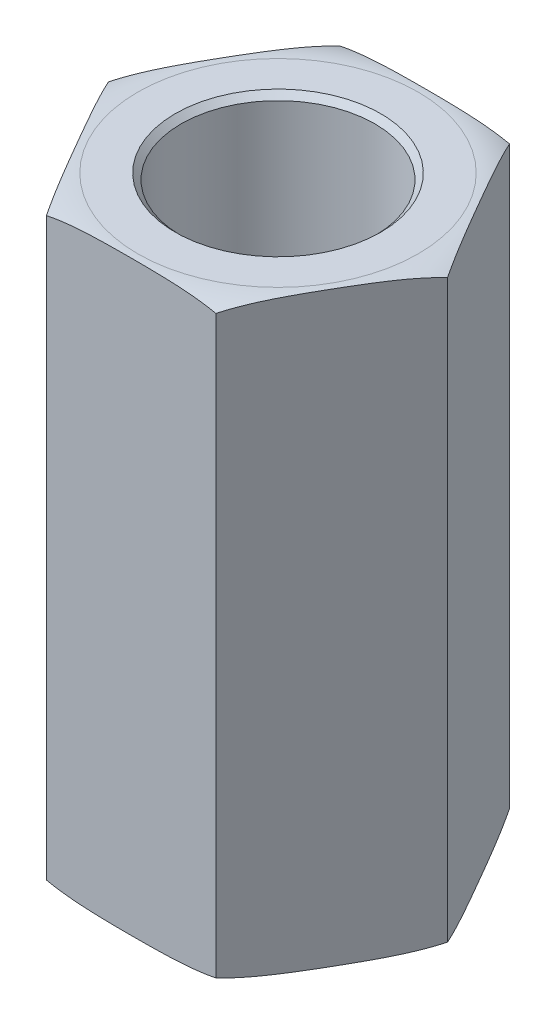
ISO-10303-21;
HEADER;
FILE_DESCRIPTION(('STEP AP214'),'2;1');
FILE_NAME('part.step','',(''),(''),'','','');
FILE_SCHEMA(('AUTOMOTIVE_DESIGN { 1 0 10303 214 1 1 1 1 }'));
ENDSEC;
DATA;
#1=APPLICATION_CONTEXT('core data for automotive mechanical design processes');
#2=APPLICATION_PROTOCOL_DEFINITION('international standard','automotive_design',2000,#1);
#3=PRODUCT_CONTEXT('',#1,'mechanical');
#4=PRODUCT('Part','Part','',(#3));
#5=PRODUCT_RELATED_PRODUCT_CATEGORY('part','',(#4));
#6=PRODUCT_DEFINITION_FORMATION('','',#4);
#7=PRODUCT_DEFINITION_CONTEXT('part definition',#1,'design');
#8=PRODUCT_DEFINITION('design','',#6,#7);
#9=PRODUCT_DEFINITION_SHAPE('','',#8);
#10=(LENGTH_UNIT() NAMED_UNIT(*) SI_UNIT(.MILLI.,.METRE.));
#11=(NAMED_UNIT(*) PLANE_ANGLE_UNIT() SI_UNIT($,.RADIAN.));
#12=(NAMED_UNIT(*) SI_UNIT($,.STERADIAN.) SOLID_ANGLE_UNIT());
#13=UNCERTAINTY_MEASURE_WITH_UNIT(LENGTH_MEASURE(1.E-05),#10,'distance_accuracy_value','');
#14=(GEOMETRIC_REPRESENTATION_CONTEXT(3) GLOBAL_UNCERTAINTY_ASSIGNED_CONTEXT((#13)) GLOBAL_UNIT_ASSIGNED_CONTEXT((#10,
#11,#12)) REPRESENTATION_CONTEXT('',''));
#15=CARTESIAN_POINT('',(0.,0.,0.));
#16=DIRECTION('',(0.,0.,1.));
#17=DIRECTION('',(1.,0.,0.));
#18=AXIS2_PLACEMENT_3D('',#15,#16,#17);
#19=CARTESIAN_POINT('',(3.66617420935412,6.35,0.));
#20=DIRECTION('',(-0.866025403784439,0.,0.5));
#21=DIRECTION('',(0.5,0.,0.866025403784439));
#22=AXIS2_PLACEMENT_3D('',#19,#20,#21);
#23=PLANE('',#22);
#24=DIRECTION('',(0.,1.,0.));
#25=VECTOR('',#24,1.);
#26=CARTESIAN_POINT('',(1.83308710467704,6.35,-3.175));
#27=LINE('',#26,#25);
#28=CARTESIAN_POINT('',(1.83308710467705,-6.223,-3.175));
#29=VERTEX_POINT('',#28);
#30=CARTESIAN_POINT('',(1.83308710467706,6.223,-3.175));
#31=VERTEX_POINT('',#30);
#32=EDGE_CURVE('E144',#29,#31,#27,.T.);
#33=ORIENTED_EDGE('',*,*,#32,.T.);
#34=CARTESIAN_POINT('',(3.66617420935412,6.223,0.));
#35=CARTESIAN_POINT('',(3.62797961467394,6.23890141489968,-0.0661549785605611));
#36=CARTESIAN_POINT('',(3.58956810864156,6.2524886076105,-0.132685658603882));
#37=CARTESIAN_POINT('',(3.5124905179571,6.27581619794021,-0.266187961794374));
#38=CARTESIAN_POINT('',(3.47382473049845,6.28556047713974,-0.33315907018741));
#39=CARTESIAN_POINT('',(3.39641631867871,6.3019966530451,-0.467234372392409));
#40=CARTESIAN_POINT('',(3.3576739963331,6.30869453286691,-0.534338043098217));
#41=CARTESIAN_POINT('',(3.28009834620111,6.31977675729319,-0.668703010557023));
#42=CARTESIAN_POINT('',(3.24126499587768,6.32416045047396,-0.735964346345314));
#43=CARTESIAN_POINT('',(3.16354065964311,6.33124030042628,-0.870586845688153));
#44=CARTESIAN_POINT('',(3.12464965374472,6.33393552375912,-0.937948043861629));
#45=CARTESIAN_POINT('',(3.04685144594589,6.33815319837134,-1.07269849250701));
#46=CARTESIAN_POINT('',(3.00794424351965,6.33967560802717,-1.14008774388963));
#47=CARTESIAN_POINT('',(2.93051517598868,6.34192270588903,-1.27419882283594));
#48=CARTESIAN_POINT('',(2.89199336248929,6.34265524681808,-1.34092056101658));
#49=CARTESIAN_POINT('',(2.81494778346138,6.34357673025741,-1.47436741839149));
#50=CARTESIAN_POINT('',(2.77642401791433,6.3437656658949,-1.54109253761784));
#51=CARTESIAN_POINT('',(2.69935964431006,6.34366599668056,-1.67457194815391));
#52=CARTESIAN_POINT('',(2.66081903631815,6.34337718117655,-1.7413262393505));
#53=CARTESIAN_POINT('',(2.58373908085323,6.34222198621899,-1.87483263846089));
#54=CARTESIAN_POINT('',(2.54519973341238,6.34135559703857,-1.94158474631899));
#55=CARTESIAN_POINT('',(2.46812969629763,6.33878619406563,-2.07507396634296));
#56=CARTESIAN_POINT('',(2.42959900625957,6.33708322716165,-2.14181107913956));
#57=CARTESIAN_POINT('',(2.352556513409,6.3324387229726,-2.27525259109851));
#58=CARTESIAN_POINT('',(2.31404470975434,6.3294972471358,-2.3419569917195));
#59=CARTESIAN_POINT('',(2.25084206239936,6.32321741247487,-2.45142718811118));
#60=CARTESIAN_POINT('',(2.22613849337002,6.32039801104631,-2.49421502479829));
#61=CARTESIAN_POINT('',(2.17676945272221,6.31386967943035,-2.57972471152123));
#62=CARTESIAN_POINT('',(2.15210397034177,6.31016108091389,-2.62244658019735));
#63=CARTESIAN_POINT('',(2.1028275381169,6.30168027114968,-2.70779586442654));
#64=CARTESIAN_POINT('',(2.07821657107524,6.29690846570083,-2.7504233097661));
#65=CARTESIAN_POINT('',(2.02900094683545,6.28609877125158,-2.83566727147563));
#66=CARTESIAN_POINT('',(2.0043964608546,6.28005773130841,-2.87828349128859));
#67=CARTESIAN_POINT('',(1.95527325900931,6.26651383541611,-2.96336737271509));
#68=CARTESIAN_POINT('',(1.93075459617612,6.25901019780296,-3.00583494247583));
#69=CARTESIAN_POINT('',(1.8818215737317,6.24232035070844,-3.09058942351747));
#70=CARTESIAN_POINT('',(1.85740744053269,6.23313149780328,-3.13287594264091));
#71=CARTESIAN_POINT('',(1.83308710467705,6.223,-3.175));
#72=B_SPLINE_CURVE_WITH_KNOTS('',3,(#34,#35,#36,#37,#38,#39,#40,#41,#42,#43,#44,#45,#46,#47,#48,
#49,#50,#51,#52,#53,#54,#55,#56,#57,#58,#59,#60,#61,#62,#63,#64,#65,#66,#67,#68,#69,#70,#71),
.UNSPECIFIED.,.F.,.F.,(4,2,2,2,2,2,2,2,2,2,2,2,2,2,2,2,2,2,4),(0.,0.233977307817956,
0.467717675040722,0.700996973557543,0.934341903229807,1.16781571967247,1.40129782179833,
1.6324366580968,1.86357841666628,2.09482211846307,2.32606971471509,2.55730435147413,
2.7885275169443,2.93698369265101,3.08538458004485,3.23372892334593,3.38244598546619,
3.53124274626087,3.68027493713585),.UNSPECIFIED.);
#73=CARTESIAN_POINT('',(3.66617420935412,6.223,0.));
#74=VERTEX_POINT('',#73);
#75=EDGE_CURVE('E96',#74,#31,#72,.T.);
#76=ORIENTED_EDGE('',*,*,#75,.F.);
#77=DIRECTION('',(0.,1.,0.));
#78=VECTOR('',#77,1.);
#79=CARTESIAN_POINT('',(3.66617420935412,6.35,0.));
#80=LINE('',#79,#78);
#81=CARTESIAN_POINT('',(3.66617420935412,-6.223,0.));
#82=VERTEX_POINT('',#81);
#83=EDGE_CURVE('E146',#74,#82,#80,.F.);
#84=ORIENTED_EDGE('',*,*,#83,.T.);
#85=CARTESIAN_POINT('',(1.83308710467705,-6.223,-3.17500000000001));
#86=CARTESIAN_POINT('',(1.87128169935723,-6.23890141489968,-3.10884502143945));
#87=CARTESIAN_POINT('',(1.90969320538961,-6.2524886076105,-3.04231434139613));
#88=CARTESIAN_POINT('',(1.98677079607407,-6.2758161979402,-2.90881203820564));
#89=CARTESIAN_POINT('',(2.02543658353272,-6.28556047713974,-2.8418409298126));
#90=CARTESIAN_POINT('',(2.10284499535245,-6.30199665304509,-2.70776562760761));
#91=CARTESIAN_POINT('',(2.14158731769806,-6.30869453286691,-2.6406619569018));
#92=CARTESIAN_POINT('',(2.21916296783006,-6.31977675729319,-2.506296989443));
#93=CARTESIAN_POINT('',(2.25799631815348,-6.32416045047396,-2.43903565365471));
#94=CARTESIAN_POINT('',(2.33572065438805,-6.33124030042628,-2.30441315431187));
#95=CARTESIAN_POINT('',(2.37461166028644,-6.33393552375912,-2.2370519561384));
#96=CARTESIAN_POINT('',(2.45240986808527,-6.33815319837134,-2.10230150749301));
#97=CARTESIAN_POINT('',(2.49131707051151,-6.33967560802717,-2.0349122561104));
#98=CARTESIAN_POINT('',(2.56874613804247,-6.34192270588903,-1.90080117716409));
#99=CARTESIAN_POINT('',(2.60726795154186,-6.34265524681808,-1.83407943898346));
#100=CARTESIAN_POINT('',(2.68431353056977,-6.34357673025741,-1.70063258160855));
#101=CARTESIAN_POINT('',(2.72283729611682,-6.3437656658949,-1.63390746238219));
#102=CARTESIAN_POINT('',(2.79990166972109,-6.34366599668056,-1.50042805184613));
#103=CARTESIAN_POINT('',(2.838442277713,-6.34337718117655,-1.43367376064954));
#104=CARTESIAN_POINT('',(2.91552223317792,-6.34222198621899,-1.30016736153915));
#105=CARTESIAN_POINT('',(2.95406158061877,-6.34135559703857,-1.23341525368106));
#106=CARTESIAN_POINT('',(3.03113161773352,-6.33878619406563,-1.09992603365709));
#107=CARTESIAN_POINT('',(3.06966230777158,-6.33708322716165,-1.03318892086049));
#108=CARTESIAN_POINT('',(3.14670480062215,-6.3324387229726,-0.89974740890154));
#109=CARTESIAN_POINT('',(3.18521660427681,-6.3294972471358,-0.833043008280553));
#110=CARTESIAN_POINT('',(3.24841925163179,-6.32321741247488,-0.723572811888871));
#111=CARTESIAN_POINT('',(3.27312282066113,-6.32039801104631,-0.68078497520176));
#112=CARTESIAN_POINT('',(3.32249186130894,-6.31386967943036,-0.595275288478811));
#113=CARTESIAN_POINT('',(3.34715734368938,-6.3101610809139,-0.552553419802693));
#114=CARTESIAN_POINT('',(3.39643377591425,-6.30168027114969,-0.467204135573495));
#115=CARTESIAN_POINT('',(3.42104474295592,-6.29690846570084,-0.424576690233926));
#116=CARTESIAN_POINT('',(3.47026036719571,-6.28609877125159,-0.339332728524397));
#117=CARTESIAN_POINT('',(3.49486485317657,-6.28005773130841,-0.296716508711431));
#118=CARTESIAN_POINT('',(3.54398805502186,-6.26651383541611,-0.211632627284922));
#119=CARTESIAN_POINT('',(3.56850671785505,-6.25901019780296,-0.169165057524186));
#120=CARTESIAN_POINT('',(3.61743974029947,-6.24232035070844,-0.0844105764825379));
#121=CARTESIAN_POINT('',(3.64185387349848,-6.23313149780328,-0.0421240573590945));
#122=CARTESIAN_POINT('',(3.66617420935412,-6.223,0.));
#123=B_SPLINE_CURVE_WITH_KNOTS('',3,(#85,#86,#87,#88,#89,#90,#91,#92,#93,#94,#95,#96,#97,#98,
#99,#100,#101,#102,#103,#104,#105,#106,#107,#108,#109,#110,#111,#112,#113,#114,#115,#116,#117,
#118,#119,#120,#121,#122),.UNSPECIFIED.,.F.,.F.,(4,2,2,2,2,2,2,2,2,2,2,2,2,2,2,2,2,2,4),(0.,
0.233977307817951,0.467717675040713,0.700996973557529,0.934341903229788,1.16781571967244,
1.4012978217983,1.63243665809676,1.86357841666625,2.09482211846303,2.32606971471504,
2.55730435147408,2.78852751694424,2.93698369265097,3.08538458004482,3.23372892334591,
3.38244598546617,3.53124274626087,3.68027493713586),.UNSPECIFIED.);
#124=EDGE_CURVE('E224',#29,#82,#123,.T.);
#125=ORIENTED_EDGE('',*,*,#124,.F.);
#126=EDGE_LOOP('',(#33,#76,#84,#125));
#127=FACE_BOUND('',#126,.T.);
#128=ADVANCED_FACE('F16',(#127),#23,.F.);
#129=CARTESIAN_POINT('',(1.83308710467706,6.35,3.17499999999999));
#130=DIRECTION('',(-0.866025403784439,0.,-0.5));
#131=DIRECTION('',(-0.5,0.,0.866025403784439));
#132=AXIS2_PLACEMENT_3D('',#129,#130,#131);
#133=PLANE('',#132);
#134=ORIENTED_EDGE('',*,*,#83,.F.);
#135=CARTESIAN_POINT('',(1.83308710467706,6.223,3.17499999999999));
#136=CARTESIAN_POINT('',(1.87128169935724,6.23890141489968,3.10884502143943));
#137=CARTESIAN_POINT('',(1.90969320538962,6.2524886076105,3.04231434139611));
#138=CARTESIAN_POINT('',(1.98677079607408,6.27581619794021,2.90881203820562));
#139=CARTESIAN_POINT('',(2.02543658353273,6.28556047713974,2.84184092981258));
#140=CARTESIAN_POINT('',(2.10284499535247,6.3019966530451,2.70776562760758));
#141=CARTESIAN_POINT('',(2.14158731769808,6.30869453286691,2.64066195690177));
#142=CARTESIAN_POINT('',(2.21916296783007,6.31977675729319,2.50629698944297));
#143=CARTESIAN_POINT('',(2.2579963181535,6.32416045047396,2.43903565365468));
#144=CARTESIAN_POINT('',(2.33572065438807,6.33124030042628,2.30441315431184));
#145=CARTESIAN_POINT('',(2.37461166028646,6.33393552375912,2.23705195613836));
#146=CARTESIAN_POINT('',(2.45240986808529,6.33815319837134,2.10230150749298));
#147=CARTESIAN_POINT('',(2.49131707051153,6.33967560802717,2.03491225611036));
#148=CARTESIAN_POINT('',(2.5687461380425,6.34192270588903,1.90080117716405));
#149=CARTESIAN_POINT('',(2.60726795154189,6.34265524681808,1.83407943898341));
#150=CARTESIAN_POINT('',(2.6843135305698,6.34357673025741,1.7006325816085));
#151=CARTESIAN_POINT('',(2.72283729611685,6.3437656658949,1.63390746238215));
#152=CARTESIAN_POINT('',(2.79990166972112,6.34366599668056,1.50042805184608));
#153=CARTESIAN_POINT('',(2.83844227771304,6.34337718117655,1.43367376064949));
#154=CARTESIAN_POINT('',(2.91552223317796,6.34222198621899,1.3001673615391));
#155=CARTESIAN_POINT('',(2.9540615806188,6.34135559703857,1.233415253681));
#156=CARTESIAN_POINT('',(3.03113161773355,6.33878619406563,1.09992603365703));
#157=CARTESIAN_POINT('',(3.06966230777161,6.33708322716165,1.03318892086043));
#158=CARTESIAN_POINT('',(3.14670480062218,6.3324387229726,0.899747408901478));
#159=CARTESIAN_POINT('',(3.18521660427684,6.3294972471358,0.833043008280487));
#160=CARTESIAN_POINT('',(3.24841925163182,6.32321741247487,0.723572811888809));
#161=CARTESIAN_POINT('',(3.27312282066116,6.32039801104631,0.680784975201703));
#162=CARTESIAN_POINT('',(3.32249186130897,6.31386967943035,0.595275288478763));
#163=CARTESIAN_POINT('',(3.34715734368941,6.31016108091389,0.552553419802648));
#164=CARTESIAN_POINT('',(3.39643377591428,6.30168027114968,0.467204135573458));
#165=CARTESIAN_POINT('',(3.42104474295594,6.29690846570083,0.424576690233893));
#166=CARTESIAN_POINT('',(3.47026036719572,6.28609877125158,0.339332728524371));
#167=CARTESIAN_POINT('',(3.49486485317658,6.28005773130841,0.29671650871141));
#168=CARTESIAN_POINT('',(3.54398805502187,6.26651383541611,0.211632627284908));
#169=CARTESIAN_POINT('',(3.56850671785506,6.25901019780296,0.169165057524176));
#170=CARTESIAN_POINT('',(3.61743974029948,6.24232035070844,0.0844105764825357));
#171=CARTESIAN_POINT('',(3.64185387349849,6.23313149780328,0.0421240573590963));
#172=CARTESIAN_POINT('',(3.66617420935412,6.223,0.));
#173=B_SPLINE_CURVE_WITH_KNOTS('',3,(#135,#136,#137,#138,#139,#140,#141,#142,#143,#144,#145,
#146,#147,#148,#149,#150,#151,#152,#153,#154,#155,#156,#157,#158,#159,#160,#161,#162,#163,#164,
#165,#166,#167,#168,#169,#170,#171,#172),.UNSPECIFIED.,.F.,.F.,(4,2,2,2,2,2,2,2,2,2,2,2,2,2,2,2,
2,2,4),(0.,0.233977307817956,0.467717675040722,0.700996973557543,0.934341903229808,
1.16781571967247,1.40129782179833,1.6324366580968,1.86357841666628,2.09482211846307,
2.32606971471509,2.55730435147413,2.7885275169443,2.93698369265101,3.08538458004485,
3.23372892334593,3.38244598546618,3.53124274626086,3.68027493713584),.UNSPECIFIED.);
#174=CARTESIAN_POINT('',(1.83308710467706,6.223,3.17499999999999));
#175=VERTEX_POINT('',#174);
#176=EDGE_CURVE('E217',#175,#74,#173,.T.);
#177=ORIENTED_EDGE('',*,*,#176,.F.);
#178=DIRECTION('',(0.,1.,0.));
#179=VECTOR('',#178,1.);
#180=CARTESIAN_POINT('',(1.83308710467706,6.35,3.17499999999999));
#181=LINE('',#180,#179);
#182=CARTESIAN_POINT('',(1.83308710467706,-6.223,3.17499999999999));
#183=VERTEX_POINT('',#182);
#184=EDGE_CURVE('E141',#175,#183,#181,.F.);
#185=ORIENTED_EDGE('',*,*,#184,.T.);
#186=CARTESIAN_POINT('',(3.66617420935412,-6.223,0.));
#187=CARTESIAN_POINT('',(3.62797961467394,-6.23890141489968,0.0661549785605662));
#188=CARTESIAN_POINT('',(3.58956810864156,-6.2524886076105,0.132685658603887));
#189=CARTESIAN_POINT('',(3.5124905179571,-6.27581619794021,0.266187961794379));
#190=CARTESIAN_POINT('',(3.47382473049845,-6.28556047713974,0.333159070187415));
#191=CARTESIAN_POINT('',(3.39641631867871,-6.3019966530451,0.467234372392414));
#192=CARTESIAN_POINT('',(3.3576739963331,-6.30869453286691,0.534338043098222));
#193=CARTESIAN_POINT('',(3.28009834620111,-6.31977675729319,0.668703010557028));
#194=CARTESIAN_POINT('',(3.24126499587768,-6.32416045047396,0.73596434634532));
#195=CARTESIAN_POINT('',(3.16354065964311,-6.33124030042628,0.870586845688159));
#196=CARTESIAN_POINT('',(3.12464965374472,-6.33393552375912,0.937948043861634));
#197=CARTESIAN_POINT('',(3.04685144594589,-6.33815319837134,1.07269849250702));
#198=CARTESIAN_POINT('',(3.00794424351965,-6.33967560802717,1.14008774388963));
#199=CARTESIAN_POINT('',(2.93051517598868,-6.34192270588903,1.27419882283595));
#200=CARTESIAN_POINT('',(2.89199336248929,-6.34265524681808,1.34092056101658));
#201=CARTESIAN_POINT('',(2.81494778346138,-6.34357673025741,1.47436741839149));
#202=CARTESIAN_POINT('',(2.77642401791433,-6.3437656658949,1.54109253761785));
#203=CARTESIAN_POINT('',(2.69935964431006,-6.34366599668056,1.67457194815392));
#204=CARTESIAN_POINT('',(2.66081903631815,-6.34337718117655,1.74132623935051));
#205=CARTESIAN_POINT('',(2.58373908085322,-6.34222198621899,1.8748326384609));
#206=CARTESIAN_POINT('',(2.54519973341238,-6.34135559703857,1.941584746319));
#207=CARTESIAN_POINT('',(2.46812969629763,-6.33878619406563,2.07507396634296));
#208=CARTESIAN_POINT('',(2.42959900625957,-6.33708322716165,2.14181107913957));
#209=CARTESIAN_POINT('',(2.352556513409,-6.3324387229726,2.27525259109852));
#210=CARTESIAN_POINT('',(2.31404470975434,-6.3294972471358,2.34195699171951));
#211=CARTESIAN_POINT('',(2.25084206239936,-6.32321741247487,2.45142718811119));
#212=CARTESIAN_POINT('',(2.22613849337002,-6.32039801104631,2.49421502479829));
#213=CARTESIAN_POINT('',(2.17676945272221,-6.31386967943035,2.57972471152123));
#214=CARTESIAN_POINT('',(2.15210397034177,-6.31016108091389,2.62244658019735));
#215=CARTESIAN_POINT('',(2.1028275381169,-6.30168027114968,2.70779586442654));
#216=CARTESIAN_POINT('',(2.07821657107524,-6.29690846570083,2.7504233097661));
#217=CARTESIAN_POINT('',(2.02900094683546,-6.28609877125158,2.83566727147563));
#218=CARTESIAN_POINT('',(2.0043964608546,-6.28005773130841,2.87828349128859));
#219=CARTESIAN_POINT('',(1.95527325900931,-6.26651383541611,2.96336737271509));
#220=CARTESIAN_POINT('',(1.93075459617612,-6.25901019780296,3.00583494247582));
#221=CARTESIAN_POINT('',(1.88182157373171,-6.24232035070844,3.09058942351746));
#222=CARTESIAN_POINT('',(1.8574074405327,-6.23313149780328,3.1328759426409));
#223=CARTESIAN_POINT('',(1.83308710467706,-6.223,3.17499999999999));
#224=B_SPLINE_CURVE_WITH_KNOTS('',3,(#186,#187,#188,#189,#190,#191,#192,#193,#194,#195,#196,
#197,#198,#199,#200,#201,#202,#203,#204,#205,#206,#207,#208,#209,#210,#211,#212,#213,#214,#215,
#216,#217,#218,#219,#220,#221,#222,#223),.UNSPECIFIED.,.F.,.F.,(4,2,2,2,2,2,2,2,2,2,2,2,2,2,2,2,
2,2,4),(0.,0.233977307817956,0.467717675040723,0.700996973557543,0.934341903229807,
1.16781571967247,1.40129782179833,1.6324366580968,1.86357841666628,2.09482211846307,
2.32606971471509,2.55730435147414,2.7885275169443,2.93698369265102,3.08538458004485,
3.23372892334593,3.38244598546618,3.53124274626086,3.68027493713584),.UNSPECIFIED.);
#225=EDGE_CURVE('E246',#82,#183,#224,.T.);
#226=ORIENTED_EDGE('',*,*,#225,.F.);
#227=EDGE_LOOP('',(#134,#177,#185,#226));
#228=FACE_BOUND('',#227,.T.);
#229=ADVANCED_FACE('F221',(#228),#133,.F.);
#230=CARTESIAN_POINT('',(1.83308710467706,6.35,-3.175));
#231=DIRECTION('',(0.,0.,1.));
#232=DIRECTION('',(1.,0.,0.));
#233=AXIS2_PLACEMENT_3D('',#230,#231,#232);
#234=PLANE('',#233);
#235=DIRECTION('',(0.,1.,0.));
#236=VECTOR('',#235,1.);
#237=CARTESIAN_POINT('',(-1.83308710467707,6.35,-3.175));
#238=LINE('',#237,#236);
#239=CARTESIAN_POINT('',(-1.83308710467707,-6.223,-3.175));
#240=VERTEX_POINT('',#239);
#241=CARTESIAN_POINT('',(-1.83308710467706,6.223,-3.17500000000001));
#242=VERTEX_POINT('',#241);
#243=EDGE_CURVE('E103',#240,#242,#238,.T.);
#244=ORIENTED_EDGE('',*,*,#243,.T.);
#245=CARTESIAN_POINT('',(1.83308710467706,6.223,-3.175));
#246=CARTESIAN_POINT('',(1.73237579828683,6.24394001415179,-3.175));
#247=CARTESIAN_POINT('',(1.63096506893486,6.26088534953273,-3.175));
#248=CARTESIAN_POINT('',(1.42767146651469,6.28849716439842,-3.175));
#249=CARTESIAN_POINT('',(1.32579191427254,6.29918756587531,-3.175));
#250=CARTESIAN_POINT('',(1.12177634709137,6.31612804080793,-3.175));
#251=CARTESIAN_POINT('',(1.0196405664338,6.32238127071887,-3.175));
#252=CARTESIAN_POINT('',(0.815663681397375,6.33190280641833,-3.175));
#253=CARTESIAN_POINT('',(0.713823115514573,6.3351834044999,-3.175));
#254=CARTESIAN_POINT('',(0.510018485441651,6.33994548487028,-3.175));
#255=CARTESIAN_POINT('',(0.408054390577976,6.34142541008817,-3.175));
#256=CARTESIAN_POINT('',(0.20406020033787,6.34331468183792,-3.175));
#257=CARTESIAN_POINT('',(0.102030100168935,6.3437234241492,-3.175));
#258=CARTESIAN_POINT('',(-0.102030100168934,6.3437234241492,-3.175));
#259=CARTESIAN_POINT('',(-0.204060200337869,6.34331468183792,-3.175));
#260=CARTESIAN_POINT('',(-0.408054390577974,6.34142541008817,-3.175));
#261=CARTESIAN_POINT('',(-0.510018485441649,6.33994548487028,-3.175));
#262=CARTESIAN_POINT('',(-0.71382311551457,6.3351834044999,-3.175));
#263=CARTESIAN_POINT('',(-0.815663681397372,6.33190280641833,-3.175));
#264=CARTESIAN_POINT('',(-1.01964056643379,6.32238127071887,-3.175));
#265=CARTESIAN_POINT('',(-1.12177634709137,6.31612804080793,-3.175));
#266=CARTESIAN_POINT('',(-1.32579191427253,6.29918756587531,-3.175));
#267=CARTESIAN_POINT('',(-1.42767146651468,6.28849716439842,-3.175));
#268=CARTESIAN_POINT('',(-1.63096506893485,6.26088534953273,-3.175));
#269=CARTESIAN_POINT('',(-1.73237579828682,6.24394001415179,-3.175));
#270=CARTESIAN_POINT('',(-1.83308710467705,6.223,-3.175));
#271=B_SPLINE_CURVE_WITH_KNOTS('',3,(#245,#246,#247,#248,#249,#250,#251,#252,#253,#254,#255,
#256,#257,#258,#259,#260,#261,#262,#263,#264,#265,#266,#267,#268,#269,#270),.UNSPECIFIED.,.F.,
.F.,(4,2,2,2,2,2,2,2,2,2,2,2,4),(0.,0.308333242342807,0.615479423308234,0.922406891130008,
1.2280592962085,1.53397581645216,1.84006485747889,2.14615389850561,2.45207041874927,
2.75772282382776,3.06465029164953,3.37179647261496,3.68012971495777),.UNSPECIFIED.);
#272=EDGE_CURVE('E88',#31,#242,#271,.T.);
#273=ORIENTED_EDGE('',*,*,#272,.F.);
#274=ORIENTED_EDGE('',*,*,#32,.F.);
#275=CARTESIAN_POINT('',(-1.83308710467707,-6.223,-3.175));
#276=CARTESIAN_POINT('',(-1.73237579828684,-6.24394001415179,-3.175));
#277=CARTESIAN_POINT('',(-1.63096506893487,-6.26088534953273,-3.175));
#278=CARTESIAN_POINT('',(-1.4276714665147,-6.28849716439842,-3.175));
#279=CARTESIAN_POINT('',(-1.32579191427255,-6.2991875658753,-3.175));
#280=CARTESIAN_POINT('',(-1.12177634709138,-6.31612804080793,-3.175));
#281=CARTESIAN_POINT('',(-1.0196405664338,-6.32238127071887,-3.175));
#282=CARTESIAN_POINT('',(-0.81566368139738,-6.33190280641833,-3.175));
#283=CARTESIAN_POINT('',(-0.713823115514577,-6.3351834044999,-3.175));
#284=CARTESIAN_POINT('',(-0.510018485441654,-6.33994548487028,-3.175));
#285=CARTESIAN_POINT('',(-0.408054390577979,-6.34142541008817,-3.175));
#286=CARTESIAN_POINT('',(-0.204060200337872,-6.34331468183792,-3.175));
#287=CARTESIAN_POINT('',(-0.102030100168936,-6.3437234241492,-3.175));
#288=CARTESIAN_POINT('',(0.102030100168934,-6.3437234241492,-3.175));
#289=CARTESIAN_POINT('',(0.204060200337869,-6.34331468183792,-3.175));
#290=CARTESIAN_POINT('',(0.408054390577974,-6.34142541008817,-3.175));
#291=CARTESIAN_POINT('',(0.510018485441648,-6.33994548487028,-3.175));
#292=CARTESIAN_POINT('',(0.713823115514568,-6.3351834044999,-3.175));
#293=CARTESIAN_POINT('',(0.81566368139737,-6.33190280641833,-3.175));
#294=CARTESIAN_POINT('',(1.01964056643379,-6.32238127071887,-3.175));
#295=CARTESIAN_POINT('',(1.12177634709137,-6.31612804080793,-3.175));
#296=CARTESIAN_POINT('',(1.32579191427253,-6.29918756587531,-3.175));
#297=CARTESIAN_POINT('',(1.42767146651468,-6.28849716439842,-3.175));
#298=CARTESIAN_POINT('',(1.63096506893485,-6.26088534953273,-3.175));
#299=CARTESIAN_POINT('',(1.73237579828682,-6.24394001415179,-3.175));
#300=CARTESIAN_POINT('',(1.83308710467705,-6.223,-3.175));
#301=B_SPLINE_CURVE_WITH_KNOTS('',3,(#275,#276,#277,#278,#279,#280,#281,#282,#283,#284,#285,
#286,#287,#288,#289,#290,#291,#292,#293,#294,#295,#296,#297,#298,#299,#300),.UNSPECIFIED.,.F.,
.F.,(4,2,2,2,2,2,2,2,2,2,2,2,4),(0.,0.308333242342808,0.615479423308238,0.922406891130013,
1.22805929620851,1.53397581645217,1.8400648574789,2.14615389850562,2.45207041874928,
2.75772282382777,3.06465029164954,3.37179647261497,3.68012971495777),.UNSPECIFIED.);
#302=EDGE_CURVE('E105',#240,#29,#301,.T.);
#303=ORIENTED_EDGE('',*,*,#302,.F.);
#304=EDGE_LOOP('',(#244,#273,#274,#303));
#305=FACE_BOUND('',#304,.T.);
#306=ADVANCED_FACE('F104',(#305),#234,.F.);
#307=CARTESIAN_POINT('',(-1.83308710467707,6.35,3.175));
#308=DIRECTION('',(0.,0.,-1.));
#309=DIRECTION('',(-1.,0.,0.));
#310=AXIS2_PLACEMENT_3D('',#307,#308,#309);
#311=PLANE('',#310);
#312=ORIENTED_EDGE('',*,*,#184,.F.);
#313=CARTESIAN_POINT('',(-1.83308710467706,6.223,3.175));
#314=CARTESIAN_POINT('',(-1.73237579828684,6.24394001415179,3.175));
#315=CARTESIAN_POINT('',(-1.63096506893486,6.26088534953273,3.175));
#316=CARTESIAN_POINT('',(-1.42767146651469,6.28849716439842,3.175));
#317=CARTESIAN_POINT('',(-1.32579191427254,6.29918756587531,3.175));
#318=CARTESIAN_POINT('',(-1.12177634709138,6.31612804080793,3.175));
#319=CARTESIAN_POINT('',(-1.0196405664338,6.32238127071887,3.175));
#320=CARTESIAN_POINT('',(-0.815663681397378,6.33190280641833,3.175));
#321=CARTESIAN_POINT('',(-0.713823115514575,6.3351834044999,3.175));
#322=CARTESIAN_POINT('',(-0.510018485441652,6.33994548487028,3.175));
#323=CARTESIAN_POINT('',(-0.408054390577977,6.34142541008817,3.175));
#324=CARTESIAN_POINT('',(-0.204060200337871,6.34331468183792,3.175));
#325=CARTESIAN_POINT('',(-0.102030100168935,6.3437234241492,3.17499999999999));
#326=CARTESIAN_POINT('',(0.102030100168935,6.3437234241492,3.17499999999999));
#327=CARTESIAN_POINT('',(0.204060200337871,6.34331468183792,3.17499999999999));
#328=CARTESIAN_POINT('',(0.408054390577978,6.34142541008817,3.17499999999999));
#329=CARTESIAN_POINT('',(0.510018485441652,6.33994548487028,3.17499999999999));
#330=CARTESIAN_POINT('',(0.713823115514575,6.3351834044999,3.17499999999999));
#331=CARTESIAN_POINT('',(0.815663681397378,6.33190280641833,3.17499999999999));
#332=CARTESIAN_POINT('',(1.0196405664338,6.32238127071887,3.17499999999999));
#333=CARTESIAN_POINT('',(1.12177634709138,6.31612804080793,3.17499999999999));
#334=CARTESIAN_POINT('',(1.32579191427254,6.29918756587531,3.17499999999999));
#335=CARTESIAN_POINT('',(1.42767146651469,6.28849716439842,3.17499999999999));
#336=CARTESIAN_POINT('',(1.63096506893486,6.26088534953273,3.17499999999999));
#337=CARTESIAN_POINT('',(1.73237579828684,6.24394001415179,3.17499999999999));
#338=CARTESIAN_POINT('',(1.83308710467706,6.223,3.17499999999999));
#339=B_SPLINE_CURVE_WITH_KNOTS('',3,(#313,#314,#315,#316,#317,#318,#319,#320,#321,#322,#323,
#324,#325,#326,#327,#328,#329,#330,#331,#332,#333,#334,#335,#336,#337,#338),.UNSPECIFIED.,.F.,
.F.,(4,2,2,2,2,2,2,2,2,2,2,2,4),(0.,0.308333242342808,0.615479423308237,0.922406891130011,
1.2280592962085,1.53397581645216,1.84006485747889,2.14615389850562,2.45207041874928,
2.75772282382777,3.06465029164955,3.37179647261498,3.68012971495778),.UNSPECIFIED.);
#340=CARTESIAN_POINT('',(-1.83308710467707,6.223,3.175));
#341=VERTEX_POINT('',#340);
#342=EDGE_CURVE('E99',#341,#175,#339,.T.);
#343=ORIENTED_EDGE('',*,*,#342,.F.);
#344=DIRECTION('',(0.,1.,0.));
#345=VECTOR('',#344,1.);
#346=CARTESIAN_POINT('',(-1.83308710467707,6.35,3.175));
#347=LINE('',#346,#345);
#348=CARTESIAN_POINT('',(-1.83308710467706,-6.223,3.175));
#349=VERTEX_POINT('',#348);
#350=EDGE_CURVE('E107',#341,#349,#347,.F.);
#351=ORIENTED_EDGE('',*,*,#350,.T.);
#352=CARTESIAN_POINT('',(1.83308710467706,-6.223,3.17499999999999));
#353=CARTESIAN_POINT('',(1.73237579828684,-6.24394001415179,3.17499999999999));
#354=CARTESIAN_POINT('',(1.63096506893486,-6.26088534953273,3.17499999999999));
#355=CARTESIAN_POINT('',(1.4276714665147,-6.28849716439842,3.17499999999999));
#356=CARTESIAN_POINT('',(1.32579191427254,-6.29918756587531,3.17499999999999));
#357=CARTESIAN_POINT('',(1.12177634709138,-6.31612804080793,3.17499999999999));
#358=CARTESIAN_POINT('',(1.0196405664338,-6.32238127071887,3.17499999999999));
#359=CARTESIAN_POINT('',(0.815663681397378,-6.33190280641833,3.17499999999999));
#360=CARTESIAN_POINT('',(0.713823115514575,-6.3351834044999,3.17499999999999));
#361=CARTESIAN_POINT('',(0.510018485441653,-6.33994548487028,3.17499999999999));
#362=CARTESIAN_POINT('',(0.408054390577978,-6.34142541008817,3.17499999999999));
#363=CARTESIAN_POINT('',(0.204060200337871,-6.34331468183792,3.17499999999999));
#364=CARTESIAN_POINT('',(0.102030100168935,-6.3437234241492,3.17499999999999));
#365=CARTESIAN_POINT('',(-0.102030100168935,-6.3437234241492,3.17499999999999));
#366=CARTESIAN_POINT('',(-0.204060200337871,-6.34331468183792,3.175));
#367=CARTESIAN_POINT('',(-0.408054390577977,-6.34142541008817,3.175));
#368=CARTESIAN_POINT('',(-0.510018485441652,-6.33994548487028,3.175));
#369=CARTESIAN_POINT('',(-0.713823115514575,-6.3351834044999,3.175));
#370=CARTESIAN_POINT('',(-0.815663681397377,-6.33190280641833,3.175));
#371=CARTESIAN_POINT('',(-1.0196405664338,-6.32238127071887,3.175));
#372=CARTESIAN_POINT('',(-1.12177634709138,-6.31612804080793,3.175));
#373=CARTESIAN_POINT('',(-1.32579191427254,-6.29918756587531,3.175));
#374=CARTESIAN_POINT('',(-1.42767146651469,-6.28849716439842,3.175));
#375=CARTESIAN_POINT('',(-1.63096506893486,-6.26088534953273,3.175));
#376=CARTESIAN_POINT('',(-1.73237579828684,-6.24394001415179,3.175));
#377=CARTESIAN_POINT('',(-1.83308710467706,-6.223,3.175));
#378=B_SPLINE_CURVE_WITH_KNOTS('',3,(#352,#353,#354,#355,#356,#357,#358,#359,#360,#361,#362,
#363,#364,#365,#366,#367,#368,#369,#370,#371,#372,#373,#374,#375,#376,#377),.UNSPECIFIED.,.F.,
.F.,(4,2,2,2,2,2,2,2,2,2,2,2,4),(0.,0.308333242342808,0.615479423308237,0.922406891130012,
1.2280592962085,1.53397581645216,1.84006485747889,2.14615389850562,2.45207041874928,
2.75772282382777,3.06465029164955,3.37179647261498,3.68012971495778),.UNSPECIFIED.);
#379=EDGE_CURVE('E211',#183,#349,#378,.T.);
#380=ORIENTED_EDGE('',*,*,#379,.F.);
#381=EDGE_LOOP('',(#312,#343,#351,#380));
#382=FACE_BOUND('',#381,.T.);
#383=ADVANCED_FACE('F379',(#382),#311,.F.);
#384=CARTESIAN_POINT('',(-3.66617420935413,6.35,0.));
#385=DIRECTION('',(0.866025403784439,0.,-0.499999999999999));
#386=DIRECTION('',(-0.499999999999999,0.,-0.866025403784439));
#387=AXIS2_PLACEMENT_3D('',#384,#385,#386);
#388=PLANE('',#387);
#389=ORIENTED_EDGE('',*,*,#350,.F.);
#390=CARTESIAN_POINT('',(-3.66617420935412,6.223,0.));
#391=CARTESIAN_POINT('',(-3.62797961467395,6.23890141489968,0.0661549785605658));
#392=CARTESIAN_POINT('',(-3.58956810864157,6.2524886076105,0.132685658603887));
#393=CARTESIAN_POINT('',(-3.5124905179571,6.27581619794021,0.266187961794379));
#394=CARTESIAN_POINT('',(-3.47382473049845,6.28556047713974,0.333159070187414));
#395=CARTESIAN_POINT('',(-3.39641631867872,6.30199665304509,0.467234372392414));
#396=CARTESIAN_POINT('',(-3.35767399633311,6.30869453286691,0.534338043098221));
#397=CARTESIAN_POINT('',(-3.28009834620111,6.31977675729319,0.668703010557027));
#398=CARTESIAN_POINT('',(-3.24126499587769,6.32416045047396,0.735964346345319));
#399=CARTESIAN_POINT('',(-3.16354065964312,6.33124030042628,0.870586845688157));
#400=CARTESIAN_POINT('',(-3.12464965374473,6.33393552375912,0.937948043861633));
#401=CARTESIAN_POINT('',(-3.04685144594589,6.33815319837134,1.07269849250702));
#402=CARTESIAN_POINT('',(-3.00794424351966,6.33967560802717,1.14008774388963));
#403=CARTESIAN_POINT('',(-2.93051517598869,6.34192270588903,1.27419882283594));
#404=CARTESIAN_POINT('',(-2.8919933624893,6.34265524681808,1.34092056101658));
#405=CARTESIAN_POINT('',(-2.81494778346139,6.34357673025741,1.47436741839149));
#406=CARTESIAN_POINT('',(-2.77642401791434,6.3437656658949,1.54109253761785));
#407=CARTESIAN_POINT('',(-2.69935964431007,6.34366599668056,1.67457194815392));
#408=CARTESIAN_POINT('',(-2.66081903631815,6.34337718117655,1.7413262393505));
#409=CARTESIAN_POINT('',(-2.58373908085323,6.34222198621899,1.87483263846089));
#410=CARTESIAN_POINT('',(-2.54519973341239,6.34135559703857,1.94158474631899));
#411=CARTESIAN_POINT('',(-2.46812969629764,6.33878619406563,2.07507396634296));
#412=CARTESIAN_POINT('',(-2.42959900625958,6.33708322716165,2.14181107913956));
#413=CARTESIAN_POINT('',(-2.35255651340901,6.3324387229726,2.27525259109852));
#414=CARTESIAN_POINT('',(-2.31404470975435,6.3294972471358,2.3419569917195));
#415=CARTESIAN_POINT('',(-2.25084206239937,6.32321741247487,2.45142718811118));
#416=CARTESIAN_POINT('',(-2.22613849337003,6.32039801104631,2.49421502479829));
#417=CARTESIAN_POINT('',(-2.17676945272222,6.31386967943035,2.57972471152123));
#418=CARTESIAN_POINT('',(-2.15210397034178,6.31016108091389,2.62244658019735));
#419=CARTESIAN_POINT('',(-2.10282753811691,6.30168027114968,2.70779586442654));
#420=CARTESIAN_POINT('',(-2.07821657107525,6.29690846570083,2.7504233097661));
#421=CARTESIAN_POINT('',(-2.02900094683546,6.28609877125158,2.83566727147563));
#422=CARTESIAN_POINT('',(-2.00439646085461,6.28005773130841,2.87828349128859));
#423=CARTESIAN_POINT('',(-1.95527325900932,6.26651383541611,2.96336737271509));
#424=CARTESIAN_POINT('',(-1.93075459617613,6.25901019780295,3.00583494247582));
#425=CARTESIAN_POINT('',(-1.88182157373171,6.24232035070844,3.09058942351747));
#426=CARTESIAN_POINT('',(-1.8574074405327,6.23313149780328,3.13287594264091));
#427=CARTESIAN_POINT('',(-1.83308710467707,6.223,3.175));
#428=B_SPLINE_CURVE_WITH_KNOTS('',3,(#390,#391,#392,#393,#394,#395,#396,#397,#398,#399,#400,
#401,#402,#403,#404,#405,#406,#407,#408,#409,#410,#411,#412,#413,#414,#415,#416,#417,#418,#419,
#420,#421,#422,#423,#424,#425,#426,#427),.UNSPECIFIED.,.F.,.F.,(4,2,2,2,2,2,2,2,2,2,2,2,2,2,2,2,
2,2,4),(0.,0.233977307817955,0.467717675040721,0.700996973557541,0.934341903229805,
1.16781571967247,1.40129782179833,1.63243665809679,1.86357841666628,2.09482211846307,
2.32606971471509,2.55730435147413,2.78852751694429,2.93698369265101,3.08538458004484,
3.23372892334593,3.38244598546618,3.53124274626086,3.68027493713584),.UNSPECIFIED.);
#429=CARTESIAN_POINT('',(-3.66617420935413,6.223,0.));
#430=VERTEX_POINT('',#429);
#431=EDGE_CURVE('E100',#430,#341,#428,.T.);
#432=ORIENTED_EDGE('',*,*,#431,.F.);
#433=DIRECTION('',(0.,1.,0.));
#434=VECTOR('',#433,1.);
#435=CARTESIAN_POINT('',(-3.66617420935413,6.35,0.));
#436=LINE('',#435,#434);
#437=CARTESIAN_POINT('',(-3.66617420935412,-6.223,0.));
#438=VERTEX_POINT('',#437);
#439=EDGE_CURVE('E82',#430,#438,#436,.F.);
#440=ORIENTED_EDGE('',*,*,#439,.T.);
#441=CARTESIAN_POINT('',(-1.83308710467707,-6.223,3.175));
#442=CARTESIAN_POINT('',(-1.87128169935724,-6.23890141489968,3.10884502143944));
#443=CARTESIAN_POINT('',(-1.90969320538962,-6.25248860761049,3.04231434139612));
#444=CARTESIAN_POINT('',(-1.98677079607408,-6.2758161979402,2.90881203820563));
#445=CARTESIAN_POINT('',(-2.02543658353273,-6.28556047713974,2.8418409298126));
#446=CARTESIAN_POINT('',(-2.10284499535247,-6.30199665304509,2.7077656276076));
#447=CARTESIAN_POINT('',(-2.14158731769808,-6.30869453286691,2.64066195690179));
#448=CARTESIAN_POINT('',(-2.21916296783007,-6.31977675729319,2.50629698944299));
#449=CARTESIAN_POINT('',(-2.25799631815349,-6.32416045047396,2.4390356536547));
#450=CARTESIAN_POINT('',(-2.33572065438806,-6.33124030042628,2.30441315431186));
#451=CARTESIAN_POINT('',(-2.37461166028645,-6.33393552375911,2.23705195613839));
#452=CARTESIAN_POINT('',(-2.45240986808529,-6.33815319837134,2.102301507493));
#453=CARTESIAN_POINT('',(-2.49131707051152,-6.33967560802717,2.03491225611039));
#454=CARTESIAN_POINT('',(-2.56874613804249,-6.34192270588903,1.90080117716408));
#455=CARTESIAN_POINT('',(-2.60726795154188,-6.34265524681808,1.83407943898344));
#456=CARTESIAN_POINT('',(-2.68431353056979,-6.34357673025741,1.70063258160854));
#457=CARTESIAN_POINT('',(-2.72283729611684,-6.3437656658949,1.63390746238218));
#458=CARTESIAN_POINT('',(-2.79990166972111,-6.34366599668056,1.50042805184611));
#459=CARTESIAN_POINT('',(-2.83844227771302,-6.34337718117655,1.43367376064953));
#460=CARTESIAN_POINT('',(-2.91552223317794,-6.34222198621899,1.30016736153914));
#461=CARTESIAN_POINT('',(-2.95406158061879,-6.34135559703857,1.23341525368104));
#462=CARTESIAN_POINT('',(-3.03113161773353,-6.33878619406563,1.09992603365708));
#463=CARTESIAN_POINT('',(-3.06966230777159,-6.33708322716165,1.03318892086047));
#464=CARTESIAN_POINT('',(-3.14670480062216,-6.3324387229726,0.899747408901525));
#465=CARTESIAN_POINT('',(-3.18521660427682,-6.3294972471358,0.833043008280536));
#466=CARTESIAN_POINT('',(-3.2484192516318,-6.32321741247488,0.723572811888856));
#467=CARTESIAN_POINT('',(-3.27312282066114,-6.32039801104631,0.680784975201748));
#468=CARTESIAN_POINT('',(-3.32249186130896,-6.31386967943036,0.595275288478802));
#469=CARTESIAN_POINT('',(-3.3471573436894,-6.31016108091389,0.552553419802685));
#470=CARTESIAN_POINT('',(-3.39643377591426,-6.30168027114968,0.467204135573489));
#471=CARTESIAN_POINT('',(-3.42104474295593,-6.29690846570083,0.424576690233921));
#472=CARTESIAN_POINT('',(-3.47026036719571,-6.28609877125159,0.339332728524393));
#473=CARTESIAN_POINT('',(-3.49486485317657,-6.28005773130841,0.296716508711429));
#474=CARTESIAN_POINT('',(-3.54398805502187,-6.26651383541611,0.211632627284922));
#475=CARTESIAN_POINT('',(-3.56850671785506,-6.25901019780296,0.169165057524188));
#476=CARTESIAN_POINT('',(-3.61743974029948,-6.24232035070844,0.0844105764825412));
#477=CARTESIAN_POINT('',(-3.64185387349849,-6.23313149780328,0.0421240573590989));
#478=CARTESIAN_POINT('',(-3.66617420935412,-6.223,0.));
#479=B_SPLINE_CURVE_WITH_KNOTS('',3,(#441,#442,#443,#444,#445,#446,#447,#448,#449,#450,#451,
#452,#453,#454,#455,#456,#457,#458,#459,#460,#461,#462,#463,#464,#465,#466,#467,#468,#469,#470,
#471,#472,#473,#474,#475,#476,#477,#478),.UNSPECIFIED.,.F.,.F.,(4,2,2,2,2,2,2,2,2,2,2,2,2,2,2,2,
2,2,4),(0.,0.233977307817952,0.467717675040714,0.700996973557531,0.934341903229791,
1.16781571967245,1.40129782179831,1.63243665809677,1.86357841666625,2.09482211846303,
2.32606971471505,2.55730435147409,2.78852751694425,2.93698369265097,3.08538458004482,
3.23372892334591,3.38244598546616,3.53124274626086,3.68027493713585),.UNSPECIFIED.);
#480=EDGE_CURVE('E164',#349,#438,#479,.T.);
#481=ORIENTED_EDGE('',*,*,#480,.F.);
#482=EDGE_LOOP('',(#389,#432,#440,#481));
#483=FACE_BOUND('',#482,.T.);
#484=ADVANCED_FACE('F214',(#483),#388,.F.);
#485=CARTESIAN_POINT('',(-1.83308710467707,6.35,-3.175));
#486=DIRECTION('',(0.866025403784439,0.,0.5));
#487=DIRECTION('',(0.5,0.,-0.866025403784439));
#488=AXIS2_PLACEMENT_3D('',#485,#486,#487);
#489=PLANE('',#488);
#490=ORIENTED_EDGE('',*,*,#439,.F.);
#491=CARTESIAN_POINT('',(-1.83308710467706,6.22299999999999,-3.17500000000001));
#492=CARTESIAN_POINT('',(-1.87128169935723,6.23890141489968,-3.10884502143945));
#493=CARTESIAN_POINT('',(-1.90969320538961,6.25248860761049,-3.04231434139613));
#494=CARTESIAN_POINT('',(-1.98677079607408,6.2758161979402,-2.90881203820565));
#495=CARTESIAN_POINT('',(-2.02543658353272,6.28556047713973,-2.84184092981261));
#496=CARTESIAN_POINT('',(-2.10284499535246,6.30199665304509,-2.70776562760762));
#497=CARTESIAN_POINT('',(-2.14158731769807,6.30869453286691,-2.64066195690181));
#498=CARTESIAN_POINT('',(-2.21916296783006,6.31977675729319,-2.50629698944301));
#499=CARTESIAN_POINT('',(-2.25799631815348,6.32416045047396,-2.43903565365472));
#500=CARTESIAN_POINT('',(-2.33572065438805,6.33124030042628,-2.30441315431188));
#501=CARTESIAN_POINT('',(-2.37461166028644,6.33393552375911,-2.23705195613841));
#502=CARTESIAN_POINT('',(-2.45240986808527,6.33815319837134,-2.10230150749303));
#503=CARTESIAN_POINT('',(-2.49131707051151,6.33967560802717,-2.03491225611042));
#504=CARTESIAN_POINT('',(-2.56874613804247,6.34192270588903,-1.90080117716411));
#505=CARTESIAN_POINT('',(-2.60726795154186,6.34265524681808,-1.83407943898348));
#506=CARTESIAN_POINT('',(-2.68431353056977,6.34357673025741,-1.70063258160857));
#507=CARTESIAN_POINT('',(-2.72283729611682,6.3437656658949,-1.63390746238222));
#508=CARTESIAN_POINT('',(-2.79990166972109,6.34366599668056,-1.50042805184615));
#509=CARTESIAN_POINT('',(-2.838442277713,6.34337718117655,-1.43367376064956));
#510=CARTESIAN_POINT('',(-2.91552223317792,6.34222198621899,-1.30016736153918));
#511=CARTESIAN_POINT('',(-2.95406158061877,6.34135559703857,-1.23341525368108));
#512=CARTESIAN_POINT('',(-3.03113161773352,6.33878619406563,-1.09992603365712));
#513=CARTESIAN_POINT('',(-3.06966230777157,6.33708322716165,-1.03318892086051));
#514=CARTESIAN_POINT('',(-3.14670480062214,6.3324387229726,-0.899747408901567));
#515=CARTESIAN_POINT('',(-3.1852166042768,6.3294972471358,-0.83304300828058));
#516=CARTESIAN_POINT('',(-3.24841925163178,6.32321741247488,-0.723572811888898));
#517=CARTESIAN_POINT('',(-3.27312282066112,6.32039801104631,-0.680784975201786));
#518=CARTESIAN_POINT('',(-3.32249186130894,6.31386967943036,-0.595275288478835));
#519=CARTESIAN_POINT('',(-3.34715734368938,6.3101610809139,-0.552553419802715));
#520=CARTESIAN_POINT('',(-3.39643377591425,6.30168027114968,-0.467204135573515));
#521=CARTESIAN_POINT('',(-3.42104474295592,6.29690846570084,-0.424576690233944));
#522=CARTESIAN_POINT('',(-3.47026036719571,6.28609877125159,-0.339332728524412));
#523=CARTESIAN_POINT('',(-3.49486485317657,6.28005773130841,-0.296716508711445));
#524=CARTESIAN_POINT('',(-3.54398805502186,6.26651383541611,-0.211632627284932));
#525=CARTESIAN_POINT('',(-3.56850671785506,6.25901019780296,-0.169165057524196));
#526=CARTESIAN_POINT('',(-3.61743974029948,6.24232035070844,-0.0844105764825444));
#527=CARTESIAN_POINT('',(-3.64185387349849,6.23313149780328,-0.0421240573590995));
#528=CARTESIAN_POINT('',(-3.66617420935413,6.223,0.));
#529=B_SPLINE_CURVE_WITH_KNOTS('',3,(#491,#492,#493,#494,#495,#496,#497,#498,#499,#500,#501,
#502,#503,#504,#505,#506,#507,#508,#509,#510,#511,#512,#513,#514,#515,#516,#517,#518,#519,#520,
#521,#522,#523,#524,#525,#526,#527,#528),.UNSPECIFIED.,.F.,.F.,(4,2,2,2,2,2,2,2,2,2,2,2,2,2,2,2,
2,2,4),(0.,0.233977307817949,0.467717675040709,0.700996973557522,0.934341903229779,
1.16781571967243,1.40129782179829,1.63243665809675,1.86357841666623,2.09482211846301,
2.32606971471502,2.55730435147406,2.78852751694422,2.93698369265095,3.0853845800448,
3.2337289233459,3.38244598546616,3.53124274626087,3.68027493713586),.UNSPECIFIED.);
#530=EDGE_CURVE('E93',#242,#430,#529,.T.);
#531=ORIENTED_EDGE('',*,*,#530,.F.);
#532=ORIENTED_EDGE('',*,*,#243,.F.);
#533=CARTESIAN_POINT('',(-3.66617420935413,-6.223,0.));
#534=CARTESIAN_POINT('',(-3.62797961467395,-6.23890141489968,-0.0661549785605638));
#535=CARTESIAN_POINT('',(-3.58956810864157,-6.25248860761049,-0.132685658603884));
#536=CARTESIAN_POINT('',(-3.51249051795711,-6.2758161979402,-0.266187961794374));
#537=CARTESIAN_POINT('',(-3.47382473049846,-6.28556047713974,-0.333159070187409));
#538=CARTESIAN_POINT('',(-3.39641631867873,-6.30199665304509,-0.467234372392406));
#539=CARTESIAN_POINT('',(-3.35767399633312,-6.30869453286691,-0.534338043098213));
#540=CARTESIAN_POINT('',(-3.28009834620112,-6.31977675729319,-0.668703010557017));
#541=CARTESIAN_POINT('',(-3.2412649958777,-6.32416045047396,-0.735964346345307));
#542=CARTESIAN_POINT('',(-3.16354065964313,-6.33124030042628,-0.870586845688144));
#543=CARTESIAN_POINT('',(-3.12464965374474,-6.33393552375911,-0.937948043861619));
#544=CARTESIAN_POINT('',(-3.04685144594591,-6.33815319837134,-1.072698492507));
#545=CARTESIAN_POINT('',(-3.00794424351967,-6.33967560802717,-1.14008774388961));
#546=CARTESIAN_POINT('',(-2.9305151759887,-6.34192270588903,-1.27419882283593));
#547=CARTESIAN_POINT('',(-2.89199336248931,-6.34265524681808,-1.34092056101656));
#548=CARTESIAN_POINT('',(-2.8149477834614,-6.34357673025741,-1.47436741839147));
#549=CARTESIAN_POINT('',(-2.77642401791436,-6.3437656658949,-1.54109253761782));
#550=CARTESIAN_POINT('',(-2.69935964431008,-6.34366599668056,-1.67457194815389));
#551=CARTESIAN_POINT('',(-2.66081903631817,-6.34337718117655,-1.74132623935048));
#552=CARTESIAN_POINT('',(-2.58373908085325,-6.34222198621899,-1.87483263846087));
#553=CARTESIAN_POINT('',(-2.5451997334124,-6.34135559703857,-1.94158474631897));
#554=CARTESIAN_POINT('',(-2.46812969629765,-6.33878619406563,-2.07507396634293));
#555=CARTESIAN_POINT('',(-2.4295990062596,-6.33708322716165,-2.14181107913953));
#556=CARTESIAN_POINT('',(-2.35255651340903,-6.3324387229726,-2.27525259109848));
#557=CARTESIAN_POINT('',(-2.31404470975437,-6.3294972471358,-2.34195699171947));
#558=CARTESIAN_POINT('',(-2.25084206239939,-6.32321741247488,-2.45142718811115));
#559=CARTESIAN_POINT('',(-2.22613849337005,-6.32039801104631,-2.49421502479826));
#560=CARTESIAN_POINT('',(-2.17676945272223,-6.31386967943036,-2.57972471152121));
#561=CARTESIAN_POINT('',(-2.15210397034179,-6.31016108091389,-2.62244658019732));
#562=CARTESIAN_POINT('',(-2.10282753811692,-6.30168027114968,-2.70779586442652));
#563=CARTESIAN_POINT('',(-2.07821657107526,-6.29690846570083,-2.75042330976609));
#564=CARTESIAN_POINT('',(-2.02900094683547,-6.28609877125158,-2.83566727147561));
#565=CARTESIAN_POINT('',(-2.00439646085461,-6.28005773130841,-2.87828349128858));
#566=CARTESIAN_POINT('',(-1.95527325900932,-6.26651383541611,-2.96336737271509));
#567=CARTESIAN_POINT('',(-1.93075459617613,-6.25901019780295,-3.00583494247582));
#568=CARTESIAN_POINT('',(-1.88182157373171,-6.24232035070844,-3.09058942351747));
#569=CARTESIAN_POINT('',(-1.8574074405327,-6.23313149780328,-3.13287594264091));
#570=CARTESIAN_POINT('',(-1.83308710467707,-6.223,-3.175));
#571=B_SPLINE_CURVE_WITH_KNOTS('',3,(#533,#534,#535,#536,#537,#538,#539,#540,#541,#542,#543,
#544,#545,#546,#547,#548,#549,#550,#551,#552,#553,#554,#555,#556,#557,#558,#559,#560,#561,#562,
#563,#564,#565,#566,#567,#568,#569,#570),.UNSPECIFIED.,.F.,.F.,(4,2,2,2,2,2,2,2,2,2,2,2,2,2,2,2,
2,2,4),(0.,0.233977307817953,0.467717675040716,0.700996973557533,0.934341903229794,
1.16781571967245,1.40129782179831,1.63243665809677,1.86357841666626,2.09482211846304,
2.32606971471506,2.5573043514741,2.78852751694426,2.93698369265098,3.08538458004482,
3.23372892334591,3.38244598546617,3.53124274626086,3.68027493713585),.UNSPECIFIED.);
#572=EDGE_CURVE('E156',#438,#240,#571,.T.);
#573=ORIENTED_EDGE('',*,*,#572,.F.);
#574=EDGE_LOOP('',(#490,#531,#532,#573));
#575=FACE_BOUND('',#574,.T.);
#576=ADVANCED_FACE('F109',(#575),#489,.F.);
#577=CARTESIAN_POINT('',(0.,4.69899999999997,0.));
#578=DIRECTION('',(0.,1.,0.));
#579=DIRECTION('',(0.,0.,1.));
#580=AXIS2_PLACEMENT_3D('',#577,#578,#579);
#581=TOROIDAL_SURFACE('',#580,3.03117420935411,1.65100000000003);
#582=CARTESIAN_POINT('',(0.,6.35,0.));
#583=DIRECTION('',(0.,-1.,0.));
#584=DIRECTION('',(0.,0.,1.));
#585=AXIS2_PLACEMENT_3D('',#582,#583,#584);
#586=CIRCLE('',#585,3.03117420935412);
#587=CARTESIAN_POINT('',(0.,6.35,3.03117420935412));
#588=VERTEX_POINT('',#587);
#589=CARTESIAN_POINT('',(0.,6.35,-3.03117420935412));
#590=VERTEX_POINT('',#589);
#591=EDGE_CURVE('E163',#588,#590,#586,.T.);
#592=ORIENTED_EDGE('',*,*,#591,.T.);
#593=CARTESIAN_POINT('',(0.,6.35,0.));
#594=DIRECTION('',(0.,-1.,0.));
#595=DIRECTION('',(0.,0.,-1.));
#596=AXIS2_PLACEMENT_3D('',#593,#594,#595);
#597=CIRCLE('',#596,3.03117420935412);
#598=EDGE_CURVE('E200',#590,#588,#597,.T.);
#599=ORIENTED_EDGE('',*,*,#598,.T.);
#600=EDGE_LOOP('',(#592,#599));
#601=FACE_BOUND('',#600,.T.);
#602=ORIENTED_EDGE('',*,*,#176,.T.);
#603=ORIENTED_EDGE('',*,*,#75,.T.);
#604=ORIENTED_EDGE('',*,*,#272,.T.);
#605=ORIENTED_EDGE('',*,*,#530,.T.);
#606=ORIENTED_EDGE('',*,*,#431,.T.);
#607=ORIENTED_EDGE('',*,*,#342,.T.);
#608=EDGE_LOOP('',(#602,#603,#604,#605,#606,#607));
#609=FACE_BOUND('',#608,.T.);
#610=ADVANCED_FACE('F91',(#601,#609),#581,.T.);
#611=CARTESIAN_POINT('',(0.,-4.69899999999997,0.));
#612=DIRECTION('',(0.,-1.,0.));
#613=DIRECTION('',(0.,0.,1.));
#614=AXIS2_PLACEMENT_3D('',#611,#612,#613);
#615=TOROIDAL_SURFACE('',#614,3.03117420935411,1.65100000000003);
#616=CARTESIAN_POINT('',(0.,-6.35,0.));
#617=DIRECTION('',(0.,1.,0.));
#618=DIRECTION('',(0.,0.,1.));
#619=AXIS2_PLACEMENT_3D('',#616,#617,#618);
#620=CIRCLE('',#619,3.03117420935412);
#621=CARTESIAN_POINT('',(0.,-6.35,-3.03117420935412));
#622=VERTEX_POINT('',#621);
#623=CARTESIAN_POINT('',(0.,-6.35,3.03117420935412));
#624=VERTEX_POINT('',#623);
#625=EDGE_CURVE('E36',#622,#624,#620,.F.);
#626=ORIENTED_EDGE('',*,*,#625,.F.);
#627=CARTESIAN_POINT('',(0.,-6.35,0.));
#628=DIRECTION('',(0.,1.,0.));
#629=DIRECTION('',(0.,0.,-1.));
#630=AXIS2_PLACEMENT_3D('',#627,#628,#629);
#631=CIRCLE('',#630,3.03117420935412);
#632=EDGE_CURVE('E155',#624,#622,#631,.F.);
#633=ORIENTED_EDGE('',*,*,#632,.F.);
#634=EDGE_LOOP('',(#626,#633));
#635=FACE_BOUND('',#634,.T.);
#636=ORIENTED_EDGE('',*,*,#480,.T.);
#637=ORIENTED_EDGE('',*,*,#572,.T.);
#638=ORIENTED_EDGE('',*,*,#302,.T.);
#639=ORIENTED_EDGE('',*,*,#124,.T.);
#640=ORIENTED_EDGE('',*,*,#225,.T.);
#641=ORIENTED_EDGE('',*,*,#379,.T.);
#642=EDGE_LOOP('',(#636,#637,#638,#639,#640,#641));
#643=FACE_BOUND('',#642,.T.);
#644=ADVANCED_FACE('F170',(#635,#643),#615,.T.);
#645=CARTESIAN_POINT('',(-1.83308710467707,6.35,-3.175));
#646=DIRECTION('',(0.,-1.,0.));
#647=DIRECTION('',(0.,0.,-1.));
#648=AXIS2_PLACEMENT_3D('',#645,#646,#647);
#649=PLANE('',#648);
#650=ORIENTED_EDGE('',*,*,#591,.F.);
#651=ORIENTED_EDGE('',*,*,#598,.F.);
#652=EDGE_LOOP('',(#650,#651));
#653=FACE_BOUND('',#652,.T.);
#654=CARTESIAN_POINT('',(0.,6.34999999994079,0.));
#655=DIRECTION('',(0.,1.,0.));
#656=DIRECTION('',(-1.,0.,0.));
#657=AXIS2_PLACEMENT_3D('',#654,#655,#656);
#658=CIRCLE('',#657,2.22249999995938);
#659=CARTESIAN_POINT('',(-2.22249999995938,6.34999999994079,0.));
#660=VERTEX_POINT('',#659);
#661=EDGE_CURVE('E152',#660,#660,#658,.F.);
#662=ORIENTED_EDGE('',*,*,#661,.T.);
#663=EDGE_LOOP('',(#662));
#664=FACE_BOUND('',#663,.T.);
#665=ADVANCED_FACE('F175',(#653,#664),#649,.F.);
#666=CARTESIAN_POINT('',(-1.83308710467707,-6.35,-3.175));
#667=DIRECTION('',(0.,-1.,0.));
#668=DIRECTION('',(0.,0.,-1.));
#669=AXIS2_PLACEMENT_3D('',#666,#667,#668);
#670=PLANE('',#669);
#671=ORIENTED_EDGE('',*,*,#625,.T.);
#672=ORIENTED_EDGE('',*,*,#632,.T.);
#673=EDGE_LOOP('',(#671,#672));
#674=FACE_BOUND('',#673,.T.);
#675=CARTESIAN_POINT('',(0.,-6.34999999999764,0.));
#676=DIRECTION('',(0.,-1.,0.));
#677=DIRECTION('',(0.,0.,-1.));
#678=AXIS2_PLACEMENT_3D('',#675,#676,#677);
#679=CIRCLE('',#678,2.22249999995938);
#680=CARTESIAN_POINT('',(0.,-6.34999999999764,-2.22249999995938));
#681=VERTEX_POINT('',#680);
#682=EDGE_CURVE('E149',#681,#681,#679,.F.);
#683=ORIENTED_EDGE('',*,*,#682,.T.);
#684=EDGE_LOOP('',(#683));
#685=FACE_BOUND('',#684,.T.);
#686=ADVANCED_FACE('F204',(#674,#685),#670,.T.);
#687=CARTESIAN_POINT('',(0.,6.34999999988395,0.));
#688=DIRECTION('',(0.,1.,0.));
#689=DIRECTION('',(-1.,0.,0.));
#690=AXIS2_PLACEMENT_3D('',#687,#688,#689);
#691=CONICAL_SURFACE('',#690,2.22249999990254,0.785398163397448);
#692=ORIENTED_EDGE('',*,*,#661,.F.);
#693=EDGE_LOOP('',(#692));
#694=FACE_BOUND('',#693,.T.);
#695=CARTESIAN_POINT('',(0.,6.223,0.));
#696=DIRECTION('',(0.,1.,0.));
#697=DIRECTION('',(0.,0.,1.));
#698=AXIS2_PLACEMENT_3D('',#695,#696,#697);
#699=CIRCLE('',#698,2.0955);
#700=CARTESIAN_POINT('',(0.,6.223,2.0955));
#701=VERTEX_POINT('',#700);
#702=EDGE_CURVE('E28',#701,#701,#699,.F.);
#703=ORIENTED_EDGE('',*,*,#702,.T.);
#704=EDGE_LOOP('',(#703));
#705=FACE_BOUND('',#704,.T.);
#706=ADVANCED_FACE('F274',(#694,#705),#691,.F.);
#707=CARTESIAN_POINT('',(0.,-6.34999999994079,0.));
#708=DIRECTION('',(0.,-1.,0.));
#709=DIRECTION('',(0.,0.,-1.));
#710=AXIS2_PLACEMENT_3D('',#707,#708,#709);
#711=CONICAL_SURFACE('',#710,2.22249999990254,0.785398163397448);
#712=CARTESIAN_POINT('',(0.,-6.223,0.));
#713=DIRECTION('',(0.,1.,0.));
#714=DIRECTION('',(0.,0.,1.));
#715=AXIS2_PLACEMENT_3D('',#712,#713,#714);
#716=CIRCLE('',#715,2.0955);
#717=CARTESIAN_POINT('',(0.,-6.223,2.0955));
#718=VERTEX_POINT('',#717);
#719=EDGE_CURVE('E11',#718,#718,#716,.T.);
#720=ORIENTED_EDGE('',*,*,#719,.T.);
#721=EDGE_LOOP('',(#720));
#722=FACE_BOUND('',#721,.T.);
#723=ORIENTED_EDGE('',*,*,#682,.F.);
#724=EDGE_LOOP('',(#723));
#725=FACE_BOUND('',#724,.T.);
#726=ADVANCED_FACE('F268',(#722,#725),#711,.F.);
#727=CARTESIAN_POINT('',(0.,-6.35,0.));
#728=DIRECTION('',(0.,1.,0.));
#729=DIRECTION('',(0.,0.,1.));
#730=AXIS2_PLACEMENT_3D('',#727,#728,#729);
#731=CYLINDRICAL_SURFACE('',#730,2.0955);
#732=ORIENTED_EDGE('',*,*,#702,.F.);
#733=EDGE_LOOP('',(#732));
#734=FACE_BOUND('',#733,.T.);
#735=ORIENTED_EDGE('',*,*,#719,.F.);
#736=EDGE_LOOP('',(#735));
#737=FACE_BOUND('',#736,.T.);
#738=ADVANCED_FACE('F266',(#734,#737),#731,.F.);
#739=CLOSED_SHELL('',(#128,#229,#306,#383,#484,#576,#610,#644,#665,#686,#706,#726,#738));
#740=MANIFOLD_SOLID_BREP('B1',#739);
#741=ADVANCED_BREP_SHAPE_REPRESENTATION('',(#18,#740),#14);
#742=SHAPE_DEFINITION_REPRESENTATION(#9,#741);
ENDSEC;
END-ISO-10303-21;
